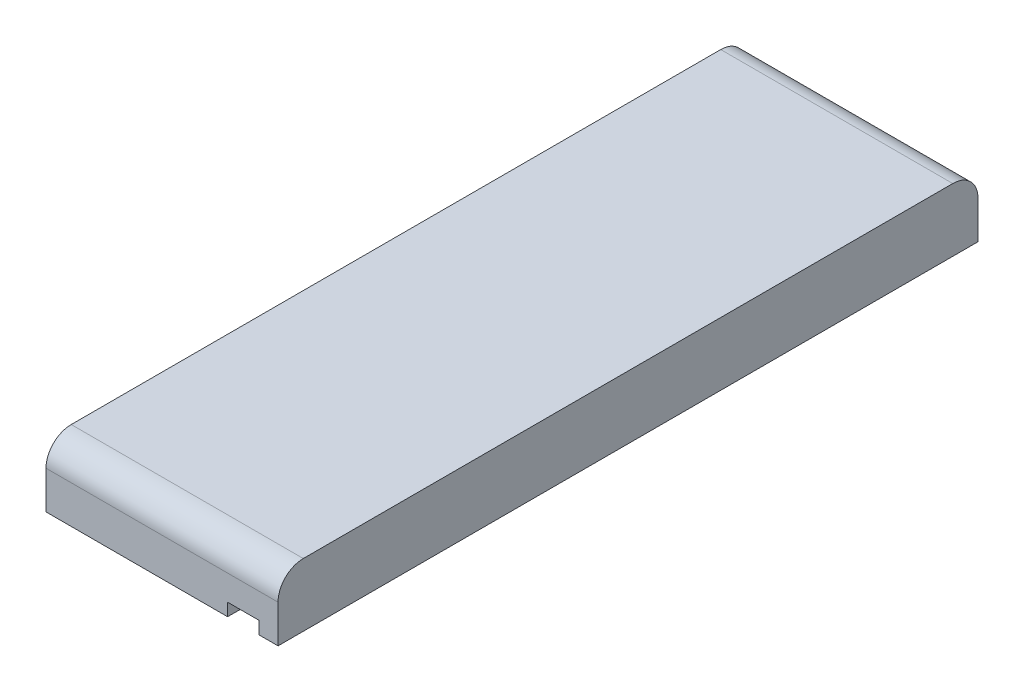
ISO-10303-21;
HEADER;
FILE_DESCRIPTION(('STEP AP214'),'2;1');
FILE_NAME('part.step','',(''),(''),'','','');
FILE_SCHEMA(('AUTOMOTIVE_DESIGN { 1 0 10303 214 1 1 1 1 }'));
ENDSEC;
DATA;
#1=APPLICATION_CONTEXT('core data for automotive mechanical design processes');
#2=APPLICATION_PROTOCOL_DEFINITION('international standard','automotive_design',2000,#1);
#3=PRODUCT_CONTEXT('',#1,'mechanical');
#4=PRODUCT('Part','Part','',(#3));
#5=PRODUCT_RELATED_PRODUCT_CATEGORY('part','',(#4));
#6=PRODUCT_DEFINITION_FORMATION('','',#4);
#7=PRODUCT_DEFINITION_CONTEXT('part definition',#1,'design');
#8=PRODUCT_DEFINITION('design','',#6,#7);
#9=PRODUCT_DEFINITION_SHAPE('','',#8);
#10=(LENGTH_UNIT() NAMED_UNIT(*) SI_UNIT(.MILLI.,.METRE.));
#11=(NAMED_UNIT(*) PLANE_ANGLE_UNIT() SI_UNIT($,.RADIAN.));
#12=(NAMED_UNIT(*) SI_UNIT($,.STERADIAN.) SOLID_ANGLE_UNIT());
#13=UNCERTAINTY_MEASURE_WITH_UNIT(LENGTH_MEASURE(1.E-05),#10,'distance_accuracy_value','');
#14=(GEOMETRIC_REPRESENTATION_CONTEXT(3) GLOBAL_UNCERTAINTY_ASSIGNED_CONTEXT((#13)) GLOBAL_UNIT_ASSIGNED_CONTEXT((#10,
#11,#12)) REPRESENTATION_CONTEXT('',''));
#15=CARTESIAN_POINT('',(0.,0.,0.));
#16=DIRECTION('',(0.,0.,1.));
#17=DIRECTION('',(1.,0.,0.));
#18=AXIS2_PLACEMENT_3D('',#15,#16,#17);
#19=CARTESIAN_POINT('',(0.,0.,55.5));
#20=DIRECTION('',(0.,1.,0.));
#21=DIRECTION('',(-1.,0.,0.));
#22=AXIS2_PLACEMENT_3D('',#19,#20,#21);
#23=PLANE('',#22);
#24=DIRECTION('',(1.,0.,0.));
#25=VECTOR('',#24,1.);
#26=CARTESIAN_POINT('',(0.,0.,55.5));
#27=LINE('',#26,#25);
#28=CARTESIAN_POINT('',(-1.5,0.,55.5));
#29=VERTEX_POINT('',#28);
#30=CARTESIAN_POINT('',(0.,0.,55.5));
#31=VERTEX_POINT('',#30);
#32=EDGE_CURVE('E194',#29,#31,#27,.T.);
#33=ORIENTED_EDGE('',*,*,#32,.F.);
#34=DIRECTION('',(0.,0.,1.));
#35=VECTOR('',#34,1.);
#36=CARTESIAN_POINT('',(-1.5,0.,0.));
#37=LINE('',#36,#35);
#38=CARTESIAN_POINT('',(-1.5,0.,0.));
#39=VERTEX_POINT('',#38);
#40=EDGE_CURVE('E179',#39,#29,#37,.T.);
#41=ORIENTED_EDGE('',*,*,#40,.F.);
#42=DIRECTION('',(1.,0.,0.));
#43=VECTOR('',#42,1.);
#44=CARTESIAN_POINT('',(0.,0.,0.));
#45=LINE('',#44,#43);
#46=CARTESIAN_POINT('',(0.,0.,0.));
#47=VERTEX_POINT('',#46);
#48=EDGE_CURVE('E202',#39,#47,#45,.T.);
#49=ORIENTED_EDGE('',*,*,#48,.T.);
#50=DIRECTION('',(0.,0.,-1.));
#51=VECTOR('',#50,1.);
#52=CARTESIAN_POINT('',(0.,0.,55.5));
#53=LINE('',#52,#51);
#54=EDGE_CURVE('E198',#31,#47,#53,.T.);
#55=ORIENTED_EDGE('',*,*,#54,.F.);
#56=EDGE_LOOP('',(#33,#41,#49,#55));
#57=FACE_BOUND('',#56,.T.);
#58=ADVANCED_FACE('F35',(#57),#23,.F.);
#59=CARTESIAN_POINT('',(0.,0.,55.5));
#60=DIRECTION('',(-1.,0.,0.));
#61=DIRECTION('',(0.,0.,1.));
#62=AXIS2_PLACEMENT_3D('',#59,#60,#61);
#63=PLANE('',#62);
#64=DIRECTION('',(0.,0.,-1.));
#65=VECTOR('',#64,1.);
#66=CARTESIAN_POINT('',(0.,5.,55.5));
#67=LINE('',#66,#65);
#68=CARTESIAN_POINT('',(0.,5.,53.5));
#69=VERTEX_POINT('',#68);
#70=CARTESIAN_POINT('',(0.,5.,2.));
#71=VERTEX_POINT('',#70);
#72=EDGE_CURVE('E213',#69,#71,#67,.T.);
#73=ORIENTED_EDGE('',*,*,#72,.F.);
#74=CARTESIAN_POINT('',(0.,3.,53.5));
#75=DIRECTION('',(-1.,0.,0.));
#76=DIRECTION('',(0.,0.,1.));
#77=AXIS2_PLACEMENT_3D('',#74,#75,#76);
#78=CIRCLE('',#77,2.);
#79=CARTESIAN_POINT('',(0.,3.,55.5));
#80=VERTEX_POINT('',#79);
#81=EDGE_CURVE('E43',#69,#80,#78,.F.);
#82=ORIENTED_EDGE('',*,*,#81,.T.);
#83=DIRECTION('',(0.,1.,0.));
#84=VECTOR('',#83,1.);
#85=CARTESIAN_POINT('',(0.,0.,55.5));
#86=LINE('',#85,#84);
#87=EDGE_CURVE('E188',#31,#80,#86,.T.);
#88=ORIENTED_EDGE('',*,*,#87,.F.);
#89=ORIENTED_EDGE('',*,*,#54,.T.);
#90=DIRECTION('',(0.,1.,0.));
#91=VECTOR('',#90,1.);
#92=CARTESIAN_POINT('',(0.,0.,0.));
#93=LINE('',#92,#91);
#94=CARTESIAN_POINT('',(0.,3.,0.));
#95=VERTEX_POINT('',#94);
#96=EDGE_CURVE('E181',#47,#95,#93,.T.);
#97=ORIENTED_EDGE('',*,*,#96,.T.);
#98=CARTESIAN_POINT('',(0.,3.,2.));
#99=DIRECTION('',(-1.,0.,0.));
#100=DIRECTION('',(0.,0.,1.));
#101=AXIS2_PLACEMENT_3D('',#98,#99,#100);
#102=CIRCLE('',#101,2.);
#103=EDGE_CURVE('E55',#95,#71,#102,.F.);
#104=ORIENTED_EDGE('',*,*,#103,.T.);
#105=EDGE_LOOP('',(#73,#82,#88,#89,#97,#104));
#106=FACE_BOUND('',#105,.T.);
#107=ADVANCED_FACE('F229',(#106),#63,.F.);
#108=CARTESIAN_POINT('',(0.,5.,55.5));
#109=DIRECTION('',(0.,-1.,0.));
#110=DIRECTION('',(1.,0.,0.));
#111=AXIS2_PLACEMENT_3D('',#108,#109,#110);
#112=PLANE('',#111);
#113=DIRECTION('',(0.,0.,-1.));
#114=VECTOR('',#113,1.);
#115=CARTESIAN_POINT('',(-18.4,5.,55.5));
#116=LINE('',#115,#114);
#117=CARTESIAN_POINT('',(-18.4,5.,53.5));
#118=VERTEX_POINT('',#117);
#119=CARTESIAN_POINT('',(-18.4,5.,2.));
#120=VERTEX_POINT('',#119);
#121=EDGE_CURVE('E210',#118,#120,#116,.T.);
#122=ORIENTED_EDGE('',*,*,#121,.F.);
#123=DIRECTION('',(-1.,0.,0.));
#124=VECTOR('',#123,1.);
#125=CARTESIAN_POINT('',(0.,5.,53.5));
#126=LINE('',#125,#124);
#127=EDGE_CURVE('E225',#118,#69,#126,.F.);
#128=ORIENTED_EDGE('',*,*,#127,.T.);
#129=ORIENTED_EDGE('',*,*,#72,.T.);
#130=DIRECTION('',(-1.,0.,0.));
#131=VECTOR('',#130,1.);
#132=CARTESIAN_POINT('',(0.,5.,2.));
#133=LINE('',#132,#131);
#134=EDGE_CURVE('E222',#71,#120,#133,.T.);
#135=ORIENTED_EDGE('',*,*,#134,.T.);
#136=EDGE_LOOP('',(#122,#128,#129,#135));
#137=FACE_BOUND('',#136,.T.);
#138=ADVANCED_FACE('F245',(#137),#112,.F.);
#139=CARTESIAN_POINT('',(-18.4,0.,55.5));
#140=DIRECTION('',(1.,0.,0.));
#141=DIRECTION('',(0.,0.,-1.));
#142=AXIS2_PLACEMENT_3D('',#139,#140,#141);
#143=PLANE('',#142);
#144=CARTESIAN_POINT('',(-18.4,3.,51.75));
#145=DIRECTION('',(-1.,0.,0.));
#146=DIRECTION('',(0.,0.,1.));
#147=AXIS2_PLACEMENT_3D('',#144,#145,#146);
#148=CIRCLE('',#147,1.);
#149=CARTESIAN_POINT('',(-18.4,3.,52.75));
#150=VERTEX_POINT('',#149);
#151=EDGE_CURVE('E498',#150,#150,#148,.T.);
#152=ORIENTED_EDGE('',*,*,#151,.F.);
#153=EDGE_LOOP('',(#152));
#154=FACE_BOUND('',#153,.T.);
#155=CARTESIAN_POINT('',(-18.4,3.,27.75));
#156=DIRECTION('',(-1.,0.,0.));
#157=DIRECTION('',(0.,0.,1.));
#158=AXIS2_PLACEMENT_3D('',#155,#156,#157);
#159=CIRCLE('',#158,0.999999999999999);
#160=CARTESIAN_POINT('',(-18.4,3.,28.75));
#161=VERTEX_POINT('',#160);
#162=EDGE_CURVE('E130',#161,#161,#159,.T.);
#163=ORIENTED_EDGE('',*,*,#162,.F.);
#164=EDGE_LOOP('',(#163));
#165=FACE_BOUND('',#164,.T.);
#166=CARTESIAN_POINT('',(-18.4,3.,3.75));
#167=DIRECTION('',(-1.,0.,0.));
#168=DIRECTION('',(0.,0.,1.));
#169=AXIS2_PLACEMENT_3D('',#166,#167,#168);
#170=CIRCLE('',#169,1.);
#171=CARTESIAN_POINT('',(-18.4,3.,4.75));
#172=VERTEX_POINT('',#171);
#173=EDGE_CURVE('E149',#172,#172,#170,.T.);
#174=ORIENTED_EDGE('',*,*,#173,.F.);
#175=EDGE_LOOP('',(#174));
#176=FACE_BOUND('',#175,.T.);
#177=DIRECTION('',(0.,-1.,0.));
#178=VECTOR('',#177,1.);
#179=CARTESIAN_POINT('',(-18.4,0.,55.5));
#180=LINE('',#179,#178);
#181=CARTESIAN_POINT('',(-18.4,3.,55.5));
#182=VERTEX_POINT('',#181);
#183=CARTESIAN_POINT('',(-18.4,0.,55.5));
#184=VERTEX_POINT('',#183);
#185=EDGE_CURVE('E191',#182,#184,#180,.T.);
#186=ORIENTED_EDGE('',*,*,#185,.F.);
#187=CARTESIAN_POINT('',(-18.4,3.,53.5));
#188=DIRECTION('',(1.,0.,0.));
#189=DIRECTION('',(0.,0.,-1.));
#190=AXIS2_PLACEMENT_3D('',#187,#188,#189);
#191=CIRCLE('',#190,2.);
#192=EDGE_CURVE('E220',#182,#118,#191,.F.);
#193=ORIENTED_EDGE('',*,*,#192,.T.);
#194=ORIENTED_EDGE('',*,*,#121,.T.);
#195=CARTESIAN_POINT('',(-18.4,3.,2.));
#196=DIRECTION('',(1.,0.,0.));
#197=DIRECTION('',(0.,0.,-1.));
#198=AXIS2_PLACEMENT_3D('',#195,#196,#197);
#199=CIRCLE('',#198,2.);
#200=CARTESIAN_POINT('',(-18.4,3.,0.));
#201=VERTEX_POINT('',#200);
#202=EDGE_CURVE('E218',#120,#201,#199,.F.);
#203=ORIENTED_EDGE('',*,*,#202,.T.);
#204=DIRECTION('',(0.,-1.,0.));
#205=VECTOR('',#204,1.);
#206=CARTESIAN_POINT('',(-18.4,0.,0.));
#207=LINE('',#206,#205);
#208=CARTESIAN_POINT('',(-18.4,0.,0.));
#209=VERTEX_POINT('',#208);
#210=EDGE_CURVE('E200',#201,#209,#207,.T.);
#211=ORIENTED_EDGE('',*,*,#210,.T.);
#212=DIRECTION('',(0.,0.,-1.));
#213=VECTOR('',#212,1.);
#214=CARTESIAN_POINT('',(-18.4,0.,55.5));
#215=LINE('',#214,#213);
#216=EDGE_CURVE('E207',#184,#209,#215,.T.);
#217=ORIENTED_EDGE('',*,*,#216,.F.);
#218=EDGE_LOOP('',(#186,#193,#194,#203,#211,#217));
#219=FACE_BOUND('',#218,.T.);
#220=ADVANCED_FACE('F242',(#154,#165,#176,#219),#143,.F.);
#221=CARTESIAN_POINT('',(-4.,0.,0.));
#222=VERTEX_POINT('',#221);
#223=EDGE_CURVE('E192',#209,#222,#45,.T.);
#224=ORIENTED_EDGE('',*,*,#223,.T.);
#225=DIRECTION('',(0.,0.,1.));
#226=VECTOR('',#225,1.);
#227=CARTESIAN_POINT('',(-4.,0.,0.));
#228=LINE('',#227,#226);
#229=CARTESIAN_POINT('',(-4.,0.,55.5));
#230=VERTEX_POINT('',#229);
#231=EDGE_CURVE('E182',#222,#230,#228,.T.);
#232=ORIENTED_EDGE('',*,*,#231,.T.);
#233=EDGE_CURVE('E195',#184,#230,#27,.T.);
#234=ORIENTED_EDGE('',*,*,#233,.F.);
#235=ORIENTED_EDGE('',*,*,#216,.T.);
#236=EDGE_LOOP('',(#224,#232,#234,#235));
#237=FACE_BOUND('',#236,.T.);
#238=ADVANCED_FACE('F251',(#237),#23,.F.);
#239=CARTESIAN_POINT('',(0.,0.,55.5));
#240=DIRECTION('',(0.,0.,1.));
#241=DIRECTION('',(1.,0.,0.));
#242=AXIS2_PLACEMENT_3D('',#239,#240,#241);
#243=PLANE('',#242);
#244=ORIENTED_EDGE('',*,*,#87,.T.);
#245=DIRECTION('',(-1.,0.,0.));
#246=VECTOR('',#245,1.);
#247=CARTESIAN_POINT('',(-18.4,3.,55.5));
#248=LINE('',#247,#246);
#249=EDGE_CURVE('E215',#80,#182,#248,.T.);
#250=ORIENTED_EDGE('',*,*,#249,.T.);
#251=ORIENTED_EDGE('',*,*,#185,.T.);
#252=ORIENTED_EDGE('',*,*,#233,.T.);
#253=DIRECTION('',(0.,-1.,0.));
#254=VECTOR('',#253,1.);
#255=CARTESIAN_POINT('',(-4.,0.,55.5));
#256=LINE('',#255,#254);
#257=CARTESIAN_POINT('',(-4.,1.,55.5));
#258=VERTEX_POINT('',#257);
#259=EDGE_CURVE('E166',#258,#230,#256,.T.);
#260=ORIENTED_EDGE('',*,*,#259,.F.);
#261=DIRECTION('',(-1.,0.,0.));
#262=VECTOR('',#261,1.);
#263=CARTESIAN_POINT('',(-1.5,1.,55.5));
#264=LINE('',#263,#262);
#265=CARTESIAN_POINT('',(-1.5,1.,55.5));
#266=VERTEX_POINT('',#265);
#267=EDGE_CURVE('E175',#266,#258,#264,.T.);
#268=ORIENTED_EDGE('',*,*,#267,.F.);
#269=DIRECTION('',(0.,1.,0.));
#270=VECTOR('',#269,1.);
#271=CARTESIAN_POINT('',(-1.5,0.,55.5));
#272=LINE('',#271,#270);
#273=EDGE_CURVE('E161',#29,#266,#272,.T.);
#274=ORIENTED_EDGE('',*,*,#273,.F.);
#275=ORIENTED_EDGE('',*,*,#32,.T.);
#276=EDGE_LOOP('',(#244,#250,#251,#252,#260,#268,#274,#275));
#277=FACE_BOUND('',#276,.T.);
#278=ADVANCED_FACE('F234',(#277),#243,.T.);
#279=CARTESIAN_POINT('',(0.,0.,0.));
#280=DIRECTION('',(0.,0.,1.));
#281=DIRECTION('',(1.,0.,0.));
#282=AXIS2_PLACEMENT_3D('',#279,#280,#281);
#283=PLANE('',#282);
#284=ORIENTED_EDGE('',*,*,#210,.F.);
#285=DIRECTION('',(-1.,0.,0.));
#286=VECTOR('',#285,1.);
#287=CARTESIAN_POINT('',(0.,3.,0.));
#288=LINE('',#287,#286);
#289=EDGE_CURVE('E11',#201,#95,#288,.F.);
#290=ORIENTED_EDGE('',*,*,#289,.T.);
#291=ORIENTED_EDGE('',*,*,#96,.F.);
#292=ORIENTED_EDGE('',*,*,#48,.F.);
#293=DIRECTION('',(0.,1.,0.));
#294=VECTOR('',#293,1.);
#295=CARTESIAN_POINT('',(-1.5,0.,0.));
#296=LINE('',#295,#294);
#297=CARTESIAN_POINT('',(-1.5,1.,0.));
#298=VERTEX_POINT('',#297);
#299=EDGE_CURVE('E162',#39,#298,#296,.T.);
#300=ORIENTED_EDGE('',*,*,#299,.T.);
#301=DIRECTION('',(-1.,0.,0.));
#302=VECTOR('',#301,1.);
#303=CARTESIAN_POINT('',(-1.5,1.,0.));
#304=LINE('',#303,#302);
#305=CARTESIAN_POINT('',(-4.,1.,0.));
#306=VERTEX_POINT('',#305);
#307=EDGE_CURVE('E165',#298,#306,#304,.T.);
#308=ORIENTED_EDGE('',*,*,#307,.T.);
#309=DIRECTION('',(0.,-1.,0.));
#310=VECTOR('',#309,1.);
#311=CARTESIAN_POINT('',(-4.,0.,0.));
#312=LINE('',#311,#310);
#313=EDGE_CURVE('E169',#306,#222,#312,.T.);
#314=ORIENTED_EDGE('',*,*,#313,.T.);
#315=ORIENTED_EDGE('',*,*,#223,.F.);
#316=EDGE_LOOP('',(#284,#290,#291,#292,#300,#308,#314,#315));
#317=FACE_BOUND('',#316,.T.);
#318=ADVANCED_FACE('F249',(#317),#283,.F.);
#319=CARTESIAN_POINT('',(-1.5,0.,0.));
#320=DIRECTION('',(1.,0.,0.));
#321=DIRECTION('',(0.,1.,0.));
#322=AXIS2_PLACEMENT_3D('',#319,#320,#321);
#323=PLANE('',#322);
#324=ORIENTED_EDGE('',*,*,#273,.T.);
#325=DIRECTION('',(0.,0.,1.));
#326=VECTOR('',#325,1.);
#327=CARTESIAN_POINT('',(-1.5,1.,0.));
#328=LINE('',#327,#326);
#329=EDGE_CURVE('E172',#298,#266,#328,.T.);
#330=ORIENTED_EDGE('',*,*,#329,.F.);
#331=ORIENTED_EDGE('',*,*,#299,.F.);
#332=ORIENTED_EDGE('',*,*,#40,.T.);
#333=EDGE_LOOP('',(#324,#330,#331,#332));
#334=FACE_BOUND('',#333,.T.);
#335=ADVANCED_FACE('F262',(#334),#323,.F.);
#336=CARTESIAN_POINT('',(-4.,0.,0.));
#337=DIRECTION('',(-1.,0.,0.));
#338=DIRECTION('',(0.,0.,1.));
#339=AXIS2_PLACEMENT_3D('',#336,#337,#338);
#340=PLANE('',#339);
#341=ORIENTED_EDGE('',*,*,#259,.T.);
#342=ORIENTED_EDGE('',*,*,#231,.F.);
#343=ORIENTED_EDGE('',*,*,#313,.F.);
#344=DIRECTION('',(0.,0.,1.));
#345=VECTOR('',#344,1.);
#346=CARTESIAN_POINT('',(-4.,1.,0.));
#347=LINE('',#346,#345);
#348=EDGE_CURVE('E185',#306,#258,#347,.T.);
#349=ORIENTED_EDGE('',*,*,#348,.T.);
#350=EDGE_LOOP('',(#341,#342,#343,#349));
#351=FACE_BOUND('',#350,.T.);
#352=ADVANCED_FACE('F256',(#351),#340,.F.);
#353=CARTESIAN_POINT('',(-1.5,1.,0.));
#354=DIRECTION('',(0.,1.,0.));
#355=DIRECTION('',(-1.,0.,0.));
#356=AXIS2_PLACEMENT_3D('',#353,#354,#355);
#357=PLANE('',#356);
#358=ORIENTED_EDGE('',*,*,#267,.T.);
#359=ORIENTED_EDGE('',*,*,#348,.F.);
#360=ORIENTED_EDGE('',*,*,#307,.F.);
#361=ORIENTED_EDGE('',*,*,#329,.T.);
#362=EDGE_LOOP('',(#358,#359,#360,#361));
#363=FACE_BOUND('',#362,.T.);
#364=ADVANCED_FACE('F260',(#363),#357,.F.);
#365=CARTESIAN_POINT('',(-11.4,3.,3.75));
#366=DIRECTION('',(-1.,0.,0.));
#367=DIRECTION('',(0.,0.,1.));
#368=AXIS2_PLACEMENT_3D('',#365,#366,#367);
#369=CONICAL_SURFACE('',#368,0.799999999999998,1.02974425867665);
#370=CARTESIAN_POINT('',(-10.9193115047779,3.,3.75));
#371=VERTEX_POINT('',#370);
#372=VERTEX_LOOP('',#371);
#373=FACE_BOUND('',#372,.T.);
#374=CARTESIAN_POINT('',(-11.4,3.,3.75));
#375=DIRECTION('',(-1.,0.,0.));
#376=DIRECTION('',(0.,0.,1.));
#377=AXIS2_PLACEMENT_3D('',#374,#375,#376);
#378=CIRCLE('',#377,0.799999999999998);
#379=CARTESIAN_POINT('',(-11.4,3.,4.55));
#380=VERTEX_POINT('',#379);
#381=EDGE_CURVE('E158',#380,#380,#378,.T.);
#382=ORIENTED_EDGE('',*,*,#381,.T.);
#383=EDGE_LOOP('',(#382));
#384=FACE_BOUND('',#383,.T.);
#385=ADVANCED_FACE('F332',(#373,#384),#369,.F.);
#386=CARTESIAN_POINT('',(-18.4,3.,3.75));
#387=DIRECTION('',(-1.,0.,0.));
#388=DIRECTION('',(0.,0.,1.));
#389=AXIS2_PLACEMENT_3D('',#386,#387,#388);
#390=CYLINDRICAL_SURFACE('',#389,0.799999999999998);
#391=ORIENTED_EDGE('',*,*,#381,.F.);
#392=EDGE_LOOP('',(#391));
#393=FACE_BOUND('',#392,.T.);
#394=CARTESIAN_POINT('',(-13.4,3.,3.75));
#395=DIRECTION('',(-1.,0.,0.));
#396=DIRECTION('',(0.,0.,1.));
#397=AXIS2_PLACEMENT_3D('',#394,#395,#396);
#398=CIRCLE('',#397,0.799999999999999);
#399=CARTESIAN_POINT('',(-13.4,3.,4.55));
#400=VERTEX_POINT('',#399);
#401=EDGE_CURVE('E155',#400,#400,#398,.T.);
#402=ORIENTED_EDGE('',*,*,#401,.T.);
#403=EDGE_LOOP('',(#402));
#404=FACE_BOUND('',#403,.T.);
#405=ADVANCED_FACE('F328',(#393,#404),#390,.F.);
#406=CARTESIAN_POINT('',(-13.4,3.8,3.75));
#407=DIRECTION('',(1.,0.,0.));
#408=DIRECTION('',(0.,0.,-1.));
#409=AXIS2_PLACEMENT_3D('',#406,#407,#408);
#410=PLANE('',#409);
#411=ORIENTED_EDGE('',*,*,#401,.F.);
#412=EDGE_LOOP('',(#411));
#413=FACE_BOUND('',#412,.T.);
#414=CARTESIAN_POINT('',(-13.4,3.,3.75));
#415=DIRECTION('',(-1.,0.,0.));
#416=DIRECTION('',(0.,0.,1.));
#417=AXIS2_PLACEMENT_3D('',#414,#415,#416);
#418=CIRCLE('',#417,0.999999999999999);
#419=CARTESIAN_POINT('',(-13.4,3.,4.75));
#420=VERTEX_POINT('',#419);
#421=EDGE_CURVE('E152',#420,#420,#418,.T.);
#422=ORIENTED_EDGE('',*,*,#421,.T.);
#423=EDGE_LOOP('',(#422));
#424=FACE_BOUND('',#423,.T.);
#425=ADVANCED_FACE('F324',(#413,#424),#410,.F.);
#426=CARTESIAN_POINT('',(-18.4,3.,3.75));
#427=DIRECTION('',(-1.,0.,0.));
#428=DIRECTION('',(0.,0.,1.));
#429=AXIS2_PLACEMENT_3D('',#426,#427,#428);
#430=CYLINDRICAL_SURFACE('',#429,0.999999999999999);
#431=ORIENTED_EDGE('',*,*,#421,.F.);
#432=EDGE_LOOP('',(#431));
#433=FACE_BOUND('',#432,.T.);
#434=ORIENTED_EDGE('',*,*,#173,.T.);
#435=EDGE_LOOP('',(#434));
#436=FACE_BOUND('',#435,.T.);
#437=ADVANCED_FACE('F320',(#433,#436),#430,.F.);
#438=CARTESIAN_POINT('',(-11.4,3.,27.75));
#439=DIRECTION('',(-1.,0.,0.));
#440=DIRECTION('',(0.,0.,1.));
#441=AXIS2_PLACEMENT_3D('',#438,#439,#440);
#442=CONICAL_SURFACE('',#441,0.799999999999998,1.02974425867665);
#443=CARTESIAN_POINT('',(-10.9193115047779,3.,27.75));
#444=VERTEX_POINT('',#443);
#445=VERTEX_LOOP('',#444);
#446=FACE_BOUND('',#445,.T.);
#447=CARTESIAN_POINT('',(-11.4,3.,27.75));
#448=DIRECTION('',(-1.,0.,0.));
#449=DIRECTION('',(0.,0.,1.));
#450=AXIS2_PLACEMENT_3D('',#447,#448,#449);
#451=CIRCLE('',#450,0.799999999999998);
#452=CARTESIAN_POINT('',(-11.4,3.,28.55));
#453=VERTEX_POINT('',#452);
#454=EDGE_CURVE('E146',#453,#453,#451,.T.);
#455=ORIENTED_EDGE('',*,*,#454,.T.);
#456=EDGE_LOOP('',(#455));
#457=FACE_BOUND('',#456,.T.);
#458=ADVANCED_FACE('F316',(#446,#457),#442,.F.);
#459=CARTESIAN_POINT('',(-18.4,3.,27.75));
#460=DIRECTION('',(-1.,0.,0.));
#461=DIRECTION('',(0.,0.,1.));
#462=AXIS2_PLACEMENT_3D('',#459,#460,#461);
#463=CYLINDRICAL_SURFACE('',#462,0.799999999999998);
#464=ORIENTED_EDGE('',*,*,#454,.F.);
#465=EDGE_LOOP('',(#464));
#466=FACE_BOUND('',#465,.T.);
#467=CARTESIAN_POINT('',(-13.4,3.,27.75));
#468=DIRECTION('',(-1.,0.,0.));
#469=DIRECTION('',(0.,0.,1.));
#470=AXIS2_PLACEMENT_3D('',#467,#468,#469);
#471=CIRCLE('',#470,0.799999999999999);
#472=CARTESIAN_POINT('',(-13.4,3.,28.55));
#473=VERTEX_POINT('',#472);
#474=EDGE_CURVE('E143',#473,#473,#471,.T.);
#475=ORIENTED_EDGE('',*,*,#474,.T.);
#476=EDGE_LOOP('',(#475));
#477=FACE_BOUND('',#476,.T.);
#478=ADVANCED_FACE('F312',(#466,#477),#463,.F.);
#479=CARTESIAN_POINT('',(-13.4,3.8,27.75));
#480=DIRECTION('',(1.,0.,0.));
#481=DIRECTION('',(0.,0.,-1.));
#482=AXIS2_PLACEMENT_3D('',#479,#480,#481);
#483=PLANE('',#482);
#484=ORIENTED_EDGE('',*,*,#474,.F.);
#485=EDGE_LOOP('',(#484));
#486=FACE_BOUND('',#485,.T.);
#487=CARTESIAN_POINT('',(-13.4,3.,27.75));
#488=DIRECTION('',(-1.,0.,0.));
#489=DIRECTION('',(0.,0.,1.));
#490=AXIS2_PLACEMENT_3D('',#487,#488,#489);
#491=CIRCLE('',#490,0.999999999999999);
#492=CARTESIAN_POINT('',(-13.4,3.,28.75));
#493=VERTEX_POINT('',#492);
#494=EDGE_CURVE('E134',#493,#493,#491,.T.);
#495=ORIENTED_EDGE('',*,*,#494,.T.);
#496=EDGE_LOOP('',(#495));
#497=FACE_BOUND('',#496,.T.);
#498=ADVANCED_FACE('F308',(#486,#497),#483,.F.);
#499=CARTESIAN_POINT('',(-18.4,3.,27.75));
#500=DIRECTION('',(-1.,0.,0.));
#501=DIRECTION('',(0.,0.,1.));
#502=AXIS2_PLACEMENT_3D('',#499,#500,#501);
#503=CYLINDRICAL_SURFACE('',#502,0.999999999999999);
#504=ORIENTED_EDGE('',*,*,#494,.F.);
#505=EDGE_LOOP('',(#504));
#506=FACE_BOUND('',#505,.T.);
#507=ORIENTED_EDGE('',*,*,#162,.T.);
#508=EDGE_LOOP('',(#507));
#509=FACE_BOUND('',#508,.T.);
#510=ADVANCED_FACE('F124',(#506,#509),#503,.F.);
#511=CARTESIAN_POINT('',(-11.4,3.,51.75));
#512=DIRECTION('',(-1.,0.,0.));
#513=DIRECTION('',(0.,0.,1.));
#514=AXIS2_PLACEMENT_3D('',#511,#512,#513);
#515=CONICAL_SURFACE('',#514,0.799999999999998,1.02974425867665);
#516=CARTESIAN_POINT('',(-10.9193115047779,3.,51.75));
#517=VERTEX_POINT('',#516);
#518=VERTEX_LOOP('',#517);
#519=FACE_BOUND('',#518,.T.);
#520=CARTESIAN_POINT('',(-11.4,3.,51.75));
#521=DIRECTION('',(-1.,0.,0.));
#522=DIRECTION('',(0.,0.,1.));
#523=AXIS2_PLACEMENT_3D('',#520,#521,#522);
#524=CIRCLE('',#523,0.799999999999998);
#525=CARTESIAN_POINT('',(-11.4,3.,52.55));
#526=VERTEX_POINT('',#525);
#527=EDGE_CURVE('E128',#526,#526,#524,.T.);
#528=ORIENTED_EDGE('',*,*,#527,.T.);
#529=EDGE_LOOP('',(#528));
#530=FACE_BOUND('',#529,.T.);
#531=ADVANCED_FACE('F120',(#519,#530),#515,.F.);
#532=CARTESIAN_POINT('',(-18.4,3.,51.75));
#533=DIRECTION('',(-1.,0.,0.));
#534=DIRECTION('',(0.,0.,1.));
#535=AXIS2_PLACEMENT_3D('',#532,#533,#534);
#536=CYLINDRICAL_SURFACE('',#535,0.799999999999998);
#537=ORIENTED_EDGE('',*,*,#527,.F.);
#538=EDGE_LOOP('',(#537));
#539=FACE_BOUND('',#538,.T.);
#540=CARTESIAN_POINT('',(-13.4,3.,51.75));
#541=DIRECTION('',(-1.,0.,0.));
#542=DIRECTION('',(0.,0.,1.));
#543=AXIS2_PLACEMENT_3D('',#540,#541,#542);
#544=CIRCLE('',#543,0.799999999999999);
#545=CARTESIAN_POINT('',(-13.4,3.,52.55));
#546=VERTEX_POINT('',#545);
#547=EDGE_CURVE('E131',#546,#546,#544,.T.);
#548=ORIENTED_EDGE('',*,*,#547,.T.);
#549=EDGE_LOOP('',(#548));
#550=FACE_BOUND('',#549,.T.);
#551=ADVANCED_FACE('F123',(#539,#550),#536,.F.);
#552=CARTESIAN_POINT('',(-13.4,3.8,51.75));
#553=DIRECTION('',(1.,0.,0.));
#554=DIRECTION('',(0.,0.,-1.));
#555=AXIS2_PLACEMENT_3D('',#552,#553,#554);
#556=PLANE('',#555);
#557=ORIENTED_EDGE('',*,*,#547,.F.);
#558=EDGE_LOOP('',(#557));
#559=FACE_BOUND('',#558,.T.);
#560=CARTESIAN_POINT('',(-13.4,3.,51.75));
#561=DIRECTION('',(-1.,0.,0.));
#562=DIRECTION('',(0.,0.,1.));
#563=AXIS2_PLACEMENT_3D('',#560,#561,#562);
#564=CIRCLE('',#563,0.999999999999999);
#565=CARTESIAN_POINT('',(-13.4,3.,52.75));
#566=VERTEX_POINT('',#565);
#567=EDGE_CURVE('E137',#566,#566,#564,.T.);
#568=ORIENTED_EDGE('',*,*,#567,.T.);
#569=EDGE_LOOP('',(#568));
#570=FACE_BOUND('',#569,.T.);
#571=ADVANCED_FACE('F293',(#559,#570),#556,.F.);
#572=CARTESIAN_POINT('',(-18.4,3.,51.75));
#573=DIRECTION('',(-1.,0.,0.));
#574=DIRECTION('',(0.,0.,1.));
#575=AXIS2_PLACEMENT_3D('',#572,#573,#574);
#576=CYLINDRICAL_SURFACE('',#575,1.);
#577=ORIENTED_EDGE('',*,*,#567,.F.);
#578=EDGE_LOOP('',(#577));
#579=FACE_BOUND('',#578,.T.);
#580=ORIENTED_EDGE('',*,*,#151,.T.);
#581=EDGE_LOOP('',(#580));
#582=FACE_BOUND('',#581,.T.);
#583=ADVANCED_FACE('F288',(#579,#582),#576,.F.);
#584=CARTESIAN_POINT('',(0.,3.,53.5));
#585=DIRECTION('',(1.,0.,0.));
#586=DIRECTION('',(0.,1.,0.));
#587=AXIS2_PLACEMENT_3D('',#584,#585,#586);
#588=CYLINDRICAL_SURFACE('',#587,2.);
#589=ORIENTED_EDGE('',*,*,#81,.F.);
#590=ORIENTED_EDGE('',*,*,#127,.F.);
#591=ORIENTED_EDGE('',*,*,#192,.F.);
#592=ORIENTED_EDGE('',*,*,#249,.F.);
#593=EDGE_LOOP('',(#589,#590,#591,#592));
#594=FACE_BOUND('',#593,.T.);
#595=ADVANCED_FACE('F239',(#594),#588,.T.);
#596=CARTESIAN_POINT('',(0.,3.,2.));
#597=DIRECTION('',(-1.,0.,0.));
#598=DIRECTION('',(0.,-1.,0.));
#599=AXIS2_PLACEMENT_3D('',#596,#597,#598);
#600=CYLINDRICAL_SURFACE('',#599,2.);
#601=ORIENTED_EDGE('',*,*,#103,.F.);
#602=ORIENTED_EDGE('',*,*,#289,.F.);
#603=ORIENTED_EDGE('',*,*,#202,.F.);
#604=ORIENTED_EDGE('',*,*,#134,.F.);
#605=EDGE_LOOP('',(#601,#602,#603,#604));
#606=FACE_BOUND('',#605,.T.);
#607=ADVANCED_FACE('F37',(#606),#600,.T.);
#608=CLOSED_SHELL('',(#58,#107,#138,#220,#238,#278,#318,#335,#352,#364,#385,#405,#425,#437,#458,
#478,#498,#510,#531,#551,#571,#583,#595,#607));
#609=MANIFOLD_SOLID_BREP('B2',#608);
#610=ADVANCED_BREP_SHAPE_REPRESENTATION('',(#18,#609),#14);
#611=SHAPE_DEFINITION_REPRESENTATION(#9,#610);
ENDSEC;
END-ISO-10303-21;
